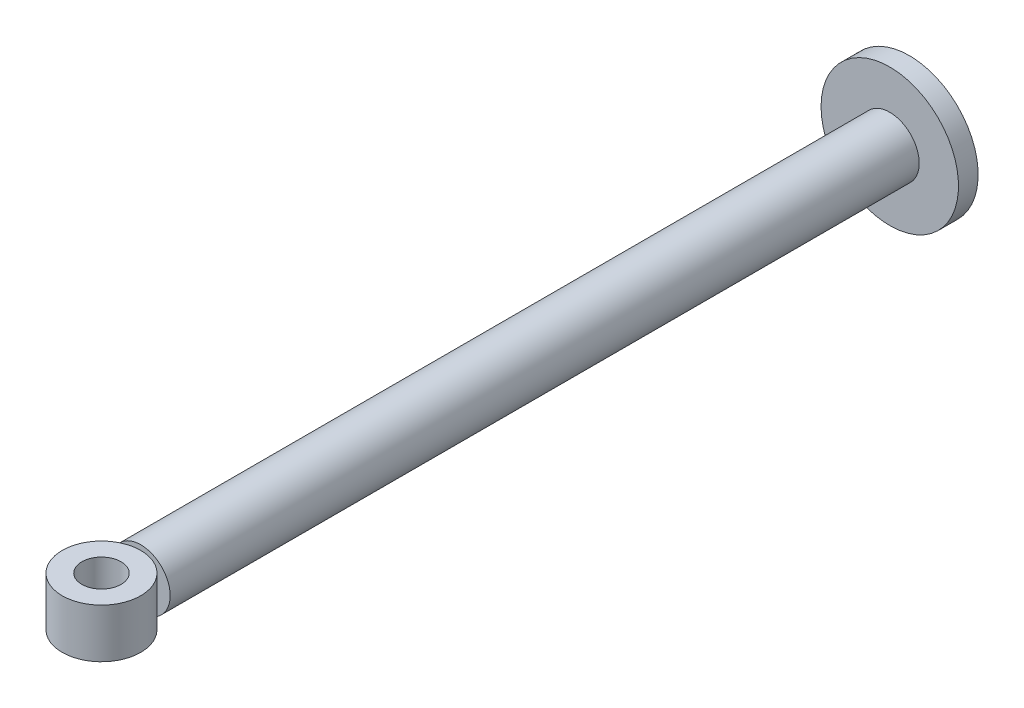
ISO-10303-21;
HEADER;
FILE_DESCRIPTION(('STEP AP214'),'2;1');
FILE_NAME('part.step','',(''),(''),'','','');
FILE_SCHEMA(('AUTOMOTIVE_DESIGN { 1 0 10303 214 1 1 1 1 }'));
ENDSEC;
DATA;
#1=APPLICATION_CONTEXT('core data for automotive mechanical design processes');
#2=APPLICATION_PROTOCOL_DEFINITION('international standard','automotive_design',2000,#1);
#3=PRODUCT_CONTEXT('',#1,'mechanical');
#4=PRODUCT('Part','Part','',(#3));
#5=PRODUCT_RELATED_PRODUCT_CATEGORY('part','',(#4));
#6=PRODUCT_DEFINITION_FORMATION('','',#4);
#7=PRODUCT_DEFINITION_CONTEXT('part definition',#1,'design');
#8=PRODUCT_DEFINITION('design','',#6,#7);
#9=PRODUCT_DEFINITION_SHAPE('','',#8);
#10=(LENGTH_UNIT() NAMED_UNIT(*) SI_UNIT(.MILLI.,.METRE.));
#11=(NAMED_UNIT(*) PLANE_ANGLE_UNIT() SI_UNIT($,.RADIAN.));
#12=(NAMED_UNIT(*) SI_UNIT($,.STERADIAN.) SOLID_ANGLE_UNIT());
#13=UNCERTAINTY_MEASURE_WITH_UNIT(LENGTH_MEASURE(1.E-05),#10,'distance_accuracy_value','');
#14=(GEOMETRIC_REPRESENTATION_CONTEXT(3) GLOBAL_UNCERTAINTY_ASSIGNED_CONTEXT((#13)) GLOBAL_UNIT_ASSIGNED_CONTEXT((#10,
#11,#12)) REPRESENTATION_CONTEXT('',''));
#15=CARTESIAN_POINT('',(0.,0.,0.));
#16=DIRECTION('',(0.,0.,1.));
#17=DIRECTION('',(1.,0.,0.));
#18=AXIS2_PLACEMENT_3D('',#15,#16,#17);
#19=CARTESIAN_POINT('',(0.,-2.5,82.3));
#20=DIRECTION('',(0.,1.,0.));
#21=DIRECTION('',(0.,0.,1.));
#22=AXIS2_PLACEMENT_3D('',#19,#20,#21);
#23=CYLINDRICAL_SURFACE('',#22,4.00000000000001);
#24=CARTESIAN_POINT('',(0.,-2.5,82.3));
#25=DIRECTION('',(0.,1.,0.));
#26=DIRECTION('',(0.,0.,1.));
#27=AXIS2_PLACEMENT_3D('',#24,#25,#26);
#28=CIRCLE('',#27,4.00000000000001);
#29=CARTESIAN_POINT('',(0.,-2.5,86.3));
#30=VERTEX_POINT('',#29);
#31=EDGE_CURVE('E11',#30,#30,#28,.T.);
#32=ORIENTED_EDGE('',*,*,#31,.T.);
#33=EDGE_LOOP('',(#32));
#34=FACE_BOUND('',#33,.T.);
#35=CARTESIAN_POINT('',(0.,2.5,82.3));
#36=DIRECTION('',(0.,1.,0.));
#37=DIRECTION('',(0.,0.,1.));
#38=AXIS2_PLACEMENT_3D('',#35,#36,#37);
#39=CIRCLE('',#38,4.00000000000001);
#40=CARTESIAN_POINT('',(0.,2.5,86.3));
#41=VERTEX_POINT('',#40);
#42=EDGE_CURVE('E49',#41,#41,#39,.T.);
#43=ORIENTED_EDGE('',*,*,#42,.F.);
#44=EDGE_LOOP('',(#43));
#45=FACE_BOUND('',#44,.T.);
#46=ADVANCED_FACE('F39',(#34,#45),#23,.T.);
#47=CARTESIAN_POINT('',(0.,-2.5,82.3));
#48=DIRECTION('',(0.,1.,0.));
#49=DIRECTION('',(0.,0.,1.));
#50=AXIS2_PLACEMENT_3D('',#47,#48,#49);
#51=PLANE('',#50);
#52=CARTESIAN_POINT('',(0.,-2.5,82.3));
#53=DIRECTION('',(0.,1.,0.));
#54=DIRECTION('',(0.,0.,1.));
#55=AXIS2_PLACEMENT_3D('',#52,#53,#54);
#56=CIRCLE('',#55,2.);
#57=CARTESIAN_POINT('',(0.,-2.5,84.3));
#58=VERTEX_POINT('',#57);
#59=EDGE_CURVE('E45',#58,#58,#56,.T.);
#60=ORIENTED_EDGE('',*,*,#59,.T.);
#61=EDGE_LOOP('',(#60));
#62=FACE_BOUND('',#61,.T.);
#63=ORIENTED_EDGE('',*,*,#31,.F.);
#64=EDGE_LOOP('',(#63));
#65=FACE_BOUND('',#64,.T.);
#66=ADVANCED_FACE('F68',(#62,#65),#51,.F.);
#67=CARTESIAN_POINT('',(0.,-2.5,82.3));
#68=DIRECTION('',(0.,1.,0.));
#69=DIRECTION('',(0.,0.,1.));
#70=AXIS2_PLACEMENT_3D('',#67,#68,#69);
#71=CYLINDRICAL_SURFACE('',#70,2.);
#72=ORIENTED_EDGE('',*,*,#59,.F.);
#73=EDGE_LOOP('',(#72));
#74=FACE_BOUND('',#73,.T.);
#75=CARTESIAN_POINT('',(0.,2.5,82.3));
#76=DIRECTION('',(0.,1.,0.));
#77=DIRECTION('',(0.,0.,1.));
#78=AXIS2_PLACEMENT_3D('',#75,#76,#77);
#79=CIRCLE('',#78,2.);
#80=CARTESIAN_POINT('',(0.,2.5,84.3));
#81=VERTEX_POINT('',#80);
#82=EDGE_CURVE('E53',#81,#81,#79,.T.);
#83=ORIENTED_EDGE('',*,*,#82,.T.);
#84=EDGE_LOOP('',(#83));
#85=FACE_BOUND('',#84,.T.);
#86=ADVANCED_FACE('F59',(#74,#85),#71,.F.);
#87=CARTESIAN_POINT('',(0.,2.5,82.3));
#88=DIRECTION('',(0.,1.,0.));
#89=DIRECTION('',(0.,0.,1.));
#90=AXIS2_PLACEMENT_3D('',#87,#88,#89);
#91=PLANE('',#90);
#92=ORIENTED_EDGE('',*,*,#42,.T.);
#93=EDGE_LOOP('',(#92));
#94=FACE_BOUND('',#93,.T.);
#95=ORIENTED_EDGE('',*,*,#82,.F.);
#96=EDGE_LOOP('',(#95));
#97=FACE_BOUND('',#96,.T.);
#98=ADVANCED_FACE('F61',(#94,#97),#91,.T.);
#99=CLOSED_SHELL('',(#46,#66,#86,#98));
#100=MANIFOLD_SOLID_BREP('B2',#99);
#101=CARTESIAN_POINT('',(0.,0.,78.3));
#102=DIRECTION('',(0.,0.,-1.));
#103=DIRECTION('',(-1.,0.,0.));
#104=AXIS2_PLACEMENT_3D('',#101,#102,#103);
#105=CYLINDRICAL_SURFACE('',#104,3.);
#106=CARTESIAN_POINT('',(0.,0.,78.3));
#107=DIRECTION('',(0.,0.,1.));
#108=DIRECTION('',(1.,0.,0.));
#109=AXIS2_PLACEMENT_3D('',#106,#107,#108);
#110=CIRCLE('',#109,3.);
#111=CARTESIAN_POINT('',(3.,0.,78.3));
#112=VERTEX_POINT('',#111);
#113=EDGE_CURVE('E107',#112,#112,#110,.T.);
#114=ORIENTED_EDGE('',*,*,#113,.F.);
#115=EDGE_LOOP('',(#114));
#116=FACE_BOUND('',#115,.T.);
#117=CARTESIAN_POINT('',(0.,0.,2.));
#118=DIRECTION('',(0.,0.,-1.));
#119=DIRECTION('',(-1.,0.,0.));
#120=AXIS2_PLACEMENT_3D('',#117,#118,#119);
#121=CIRCLE('',#120,3.);
#122=CARTESIAN_POINT('',(-3.,0.,2.));
#123=VERTEX_POINT('',#122);
#124=EDGE_CURVE('E38',#123,#123,#121,.T.);
#125=ORIENTED_EDGE('',*,*,#124,.F.);
#126=EDGE_LOOP('',(#125));
#127=FACE_BOUND('',#126,.T.);
#128=ADVANCED_FACE('F101',(#116,#127),#105,.T.);
#129=CARTESIAN_POINT('',(0.,0.,78.3));
#130=DIRECTION('',(0.,0.,1.));
#131=DIRECTION('',(1.,0.,0.));
#132=AXIS2_PLACEMENT_3D('',#129,#130,#131);
#133=PLANE('',#132);
#134=ORIENTED_EDGE('',*,*,#113,.T.);
#135=EDGE_LOOP('',(#134));
#136=FACE_BOUND('',#135,.T.);
#137=ADVANCED_FACE('F126',(#136),#133,.T.);
#138=CARTESIAN_POINT('',(0.,0.,2.));
#139=DIRECTION('',(0.,0.,-1.));
#140=DIRECTION('',(-1.,0.,0.));
#141=AXIS2_PLACEMENT_3D('',#138,#139,#140);
#142=CYLINDRICAL_SURFACE('',#141,7.);
#143=CARTESIAN_POINT('',(0.,0.,2.));
#144=DIRECTION('',(0.,0.,-1.));
#145=DIRECTION('',(-1.,0.,0.));
#146=AXIS2_PLACEMENT_3D('',#143,#144,#145);
#147=CIRCLE('',#146,7.);
#148=CARTESIAN_POINT('',(-7.,0.,2.));
#149=VERTEX_POINT('',#148);
#150=EDGE_CURVE('E111',#149,#149,#147,.T.);
#151=ORIENTED_EDGE('',*,*,#150,.T.);
#152=EDGE_LOOP('',(#151));
#153=FACE_BOUND('',#152,.T.);
#154=CARTESIAN_POINT('',(0.,0.,0.));
#155=DIRECTION('',(0.,0.,-1.));
#156=DIRECTION('',(-1.,0.,0.));
#157=AXIS2_PLACEMENT_3D('',#154,#155,#156);
#158=CIRCLE('',#157,7.);
#159=CARTESIAN_POINT('',(-7.,0.,0.));
#160=VERTEX_POINT('',#159);
#161=EDGE_CURVE('E115',#160,#160,#158,.T.);
#162=ORIENTED_EDGE('',*,*,#161,.F.);
#163=EDGE_LOOP('',(#162));
#164=FACE_BOUND('',#163,.T.);
#165=ADVANCED_FACE('F123',(#153,#164),#142,.T.);
#166=CARTESIAN_POINT('',(0.,0.,2.));
#167=DIRECTION('',(0.,0.,-1.));
#168=DIRECTION('',(-1.,0.,0.));
#169=AXIS2_PLACEMENT_3D('',#166,#167,#168);
#170=PLANE('',#169);
#171=ORIENTED_EDGE('',*,*,#124,.T.);
#172=EDGE_LOOP('',(#171));
#173=FACE_BOUND('',#172,.T.);
#174=ORIENTED_EDGE('',*,*,#150,.F.);
#175=EDGE_LOOP('',(#174));
#176=FACE_BOUND('',#175,.T.);
#177=ADVANCED_FACE('F125',(#173,#176),#170,.F.);
#178=CARTESIAN_POINT('',(0.,0.,0.));
#179=DIRECTION('',(0.,0.,1.));
#180=DIRECTION('',(1.,0.,0.));
#181=AXIS2_PLACEMENT_3D('',#178,#179,#180);
#182=PLANE('',#181);
#183=ORIENTED_EDGE('',*,*,#161,.T.);
#184=EDGE_LOOP('',(#183));
#185=FACE_BOUND('',#184,.T.);
#186=ADVANCED_FACE('F121',(#185),#182,.F.);
#187=CLOSED_SHELL('',(#128,#137,#165,#177,#186));
#188=MANIFOLD_SOLID_BREP('B6',#187);
#189=ADVANCED_BREP_SHAPE_REPRESENTATION('',(#18,#100,#188),#14);
#190=SHAPE_DEFINITION_REPRESENTATION(#9,#189);
ENDSEC;
END-ISO-10303-21;
